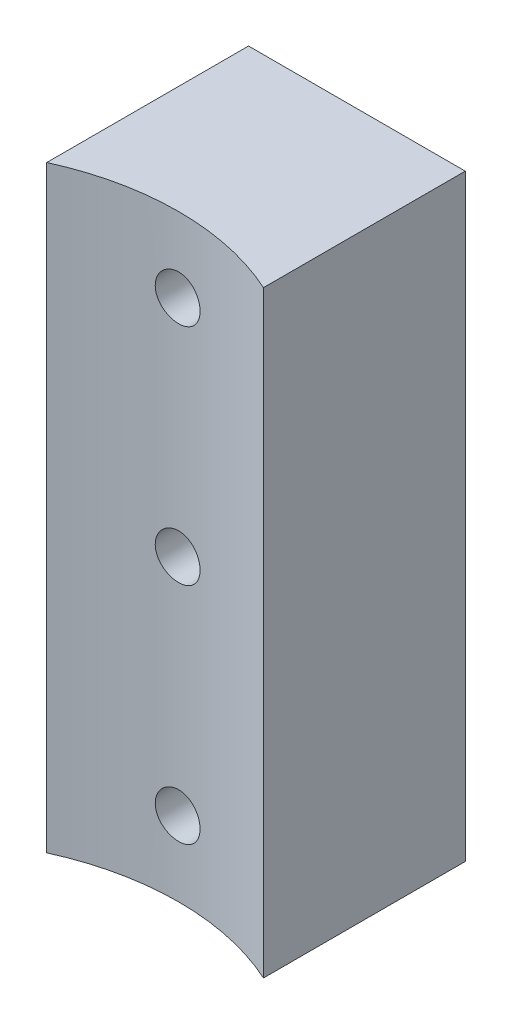
ISO-10303-21;
HEADER;
FILE_DESCRIPTION(('STEP AP214'),'2;1');
FILE_NAME('part.step','',(''),(''),'','','');
FILE_SCHEMA(('AUTOMOTIVE_DESIGN { 1 0 10303 214 1 1 1 1 }'));
ENDSEC;
DATA;
#1=APPLICATION_CONTEXT('core data for automotive mechanical design processes');
#2=APPLICATION_PROTOCOL_DEFINITION('international standard','automotive_design',2000,#1);
#3=PRODUCT_CONTEXT('',#1,'mechanical');
#4=PRODUCT('Part','Part','',(#3));
#5=PRODUCT_RELATED_PRODUCT_CATEGORY('part','',(#4));
#6=PRODUCT_DEFINITION_FORMATION('','',#4);
#7=PRODUCT_DEFINITION_CONTEXT('part definition',#1,'design');
#8=PRODUCT_DEFINITION('design','',#6,#7);
#9=PRODUCT_DEFINITION_SHAPE('','',#8);
#10=(LENGTH_UNIT() NAMED_UNIT(*) SI_UNIT(.MILLI.,.METRE.));
#11=(NAMED_UNIT(*) PLANE_ANGLE_UNIT() SI_UNIT($,.RADIAN.));
#12=(NAMED_UNIT(*) SI_UNIT($,.STERADIAN.) SOLID_ANGLE_UNIT());
#13=UNCERTAINTY_MEASURE_WITH_UNIT(LENGTH_MEASURE(1.E-05),#10,'distance_accuracy_value','');
#14=(GEOMETRIC_REPRESENTATION_CONTEXT(3) GLOBAL_UNCERTAINTY_ASSIGNED_CONTEXT((#13)) GLOBAL_UNIT_ASSIGNED_CONTEXT((#10,
#11,#12)) REPRESENTATION_CONTEXT('',''));
#15=CARTESIAN_POINT('',(0.,0.,0.));
#16=DIRECTION('',(0.,0.,1.));
#17=DIRECTION('',(1.,0.,0.));
#18=AXIS2_PLACEMENT_3D('',#15,#16,#17);
#19=CARTESIAN_POINT('',(0.,80.,45.355140872393));
#20=DIRECTION('',(0.,-1.,0.));
#21=DIRECTION('',(0.,0.,-1.));
#22=AXIS2_PLACEMENT_3D('',#19,#20,#21);
#23=CYLINDRICAL_SURFACE('',#22,35.);
#24=CARTESIAN_POINT('',(-3.,70.,10.4839493240676));
#25=CARTESIAN_POINT('',(-2.99999266095691,70.1681788977969,10.4839476198831));
#26=CARTESIAN_POINT('',(-2.98581034508464,70.3364718555865,10.4827195690312));
#27=CARTESIAN_POINT('',(-2.92944387718635,70.668400071108,10.4779401861653));
#28=CARTESIAN_POINT('',(-2.88722811123404,70.8320298525538,10.4743862312445));
#29=CARTESIAN_POINT('',(-2.77602575299662,71.1497763164806,10.4653605027679));
#30=CARTESIAN_POINT('',(-2.70705447640826,71.3038983830823,10.4598898265767));
#31=CARTESIAN_POINT('',(-2.54432647781201,71.5983417986807,10.4476484327925));
#32=CARTESIAN_POINT('',(-2.45057500494258,71.7386660618111,10.4408779906093));
#33=CARTESIAN_POINT('',(-2.24067380704697,72.0019468210089,10.4267793440726));
#34=CARTESIAN_POINT('',(-2.12447081430969,72.1248607834929,10.4194498388452));
#35=CARTESIAN_POINT('',(-1.87307803845592,72.3494663357357,10.4050708154877));
#36=CARTESIAN_POINT('',(-1.73788742116144,72.4511569926087,10.3980213096763));
#37=CARTESIAN_POINT('',(-1.45210217047512,72.6305716963779,10.3849841664228));
#38=CARTESIAN_POINT('',(-1.30148426539791,72.7082588039076,10.3789981715876));
#39=CARTESIAN_POINT('',(-0.989282152733716,72.8372248736093,10.3687765481909));
#40=CARTESIAN_POINT('',(-0.827698147061475,72.8885043218666,10.3645408874112));
#41=CARTESIAN_POINT('',(-0.498575054218786,72.9630766244092,10.3583062735014));
#42=CARTESIAN_POINT('',(-0.331051705301404,72.9864384709037,10.3563018073094));
#43=CARTESIAN_POINT('',(0.00554951687181451,73.0047257169121,10.3547367392413));
#44=CARTESIAN_POINT('',(0.174627359650706,72.9996516727498,10.3551760895541));
#45=CARTESIAN_POINT('',(0.509070191841324,72.9612675389711,10.3584446077199));
#46=CARTESIAN_POINT('',(0.674443766007422,72.9280316396164,10.3612674962547));
#47=CARTESIAN_POINT('',(0.997256506055928,72.834382628761,10.3689783939812));
#48=CARTESIAN_POINT('',(1.15469559272899,72.7739692460094,10.3738664237847));
#49=CARTESIAN_POINT('',(1.45740602670417,72.627597672851,10.3851685469964));
#50=CARTESIAN_POINT('',(1.6026612561083,72.5416063081392,10.3915846200892));
#51=CARTESIAN_POINT('',(1.87670479976717,72.3465438378033,10.4052219438467));
#52=CARTESIAN_POINT('',(2.0054927602542,72.2374722364782,10.4124432118031));
#53=CARTESIAN_POINT('',(2.24337983249144,71.9989274115879,10.4269069372816));
#54=CARTESIAN_POINT('',(2.35241430046894,71.8693897117684,10.4341493882716));
#55=CARTESIAN_POINT('',(2.54719973764136,71.593814336155,10.4478158774214));
#56=CARTESIAN_POINT('',(2.63295068598783,71.4477766455869,10.4542399148484));
#57=CARTESIAN_POINT('',(2.77873275129372,71.1433008088583,10.4655433191656));
#58=CARTESIAN_POINT('',(2.83876042932541,70.984861008014,10.4704224794993));
#59=CARTESIAN_POINT('',(2.93134369450066,70.660100511375,10.4780796259716));
#60=CARTESIAN_POINT('',(2.96389989316699,70.4937799910943,10.4808576588816));
#61=CARTESIAN_POINT('',(3.00053403997774,70.1585451904919,10.4839903442085));
#62=CARTESIAN_POINT('',(3.00470217287089,69.9896408341738,10.4843526708947));
#63=CARTESIAN_POINT('',(2.98467818807446,69.6535358314843,10.4826331742699));
#64=CARTESIAN_POINT('',(2.96048635048195,69.4863351683029,10.4805513750984));
#65=CARTESIAN_POINT('',(2.88450436177439,69.1586431948189,10.4741851877669));
#66=CARTESIAN_POINT('',(2.8327563709266,68.9981420378853,10.4699041647198));
#67=CARTESIAN_POINT('',(2.70317389532559,68.6880999611053,10.4596246741063));
#68=CARTESIAN_POINT('',(2.62533896819065,68.538559227178,10.4536261774153));
#69=CARTESIAN_POINT('',(2.44556416469073,68.2542704319917,10.440569016248));
#70=CARTESIAN_POINT('',(2.34356423538402,68.1195604686071,10.4335077268092));
#71=CARTESIAN_POINT('',(2.11844147546403,67.8691423551176,10.4191294466342));
#72=CARTESIAN_POINT('',(1.99531826047652,67.7534345508645,10.4118124512469));
#73=CARTESIAN_POINT('',(1.73105402731211,67.5439970271157,10.3977243081168));
#74=CARTESIAN_POINT('',(1.58986645530175,67.450325934563,10.3909546471913));
#75=CARTESIAN_POINT('',(1.29371299875351,67.2880232282786,10.3787453903888));
#76=CARTESIAN_POINT('',(1.13874725876361,67.2193913518968,10.3733057805603));
#77=CARTESIAN_POINT('',(0.819645734517399,67.1092157912916,10.3643763484736));
#78=CARTESIAN_POINT('',(0.65552250479355,67.0676359646391,10.3608839256061));
#79=CARTESIAN_POINT('',(0.322592960793778,67.0126266986178,10.356231794647));
#80=CARTESIAN_POINT('',(0.153786740881582,66.9991966924382,10.3550720395859));
#81=CARTESIAN_POINT('',(-0.183139370810549,67.0008750821372,10.3552158573381));
#82=CARTESIAN_POINT('',(-0.35125972839602,67.0158921579829,10.3565115477539));
#83=CARTESIAN_POINT('',(-0.682581136937826,67.0738478591427,10.3614050914978));
#84=CARTESIAN_POINT('',(-0.845782181536314,67.1167865205418,10.3650029478013));
#85=CARTESIAN_POINT('',(-1.16263730873111,67.2293430218768,10.3740972209368));
#86=CARTESIAN_POINT('',(-1.31629202900732,67.298959077572,10.3795935107952));
#87=CARTESIAN_POINT('',(-1.60974810184892,67.4628838846323,10.3918700486257));
#88=CARTESIAN_POINT('',(-1.74954965509232,67.5571922782303,10.3986502779943));
#89=CARTESIAN_POINT('',(-2.01179846018097,67.7681675615409,10.4127597969763));
#90=CARTESIAN_POINT('',(-2.1341911912239,67.8849021138727,10.4200907062253));
#91=CARTESIAN_POINT('',(-2.35769690654863,68.1372917927201,10.4344615574563));
#92=CARTESIAN_POINT('',(-2.45880473667584,68.2729514887808,10.4415014286323));
#93=CARTESIAN_POINT('',(-2.63701593547982,68.5596186650063,10.4545080517243));
#94=CARTESIAN_POINT('',(-2.71407186567634,68.7106557064792,10.4604726732226));
#95=CARTESIAN_POINT('',(-2.84163046603466,69.0234732227605,10.4706275648487));
#96=CARTESIAN_POINT('',(-2.89216358839389,69.1852411353663,10.4748198687842));
#97=CARTESIAN_POINT('',(-2.95240722581038,69.4566320780792,10.4798800238554));
#98=CARTESIAN_POINT('',(-2.97023070444527,69.564510957119,10.4813989701122));
#99=CARTESIAN_POINT('',(-2.99402945794011,69.781577186907,10.483434172228));
#100=CARTESIAN_POINT('',(-3.00000476685127,69.890764533894,10.4839504309686));
#101=CARTESIAN_POINT('',(-3.,70.,10.4839493240676));
#102=B_SPLINE_CURVE_WITH_KNOTS('',3,(#24,#25,#26,#27,#28,#29,#30,#31,#32,#33,#34,#35,#36,#37,
#38,#39,#40,#41,#42,#43,#44,#45,#46,#47,#48,#49,#50,#51,#52,#53,#54,#55,#56,#57,#58,#59,#60,#61,
#62,#63,#64,#65,#66,#67,#68,#69,#70,#71,#72,#73,#74,#75,#76,#77,#78,#79,#80,#81,#82,#83,#84,#85,
#86,#87,#88,#89,#90,#91,#92,#93,#94,#95,#96,#97,#98,#99,#100,#101),.UNSPECIFIED.,.T.,.F.,(4,2,2,
2,2,2,2,2,2,2,2,2,2,2,2,2,2,2,2,2,2,2,2,2,2,2,2,2,2,2,2,2,2,2,2,2,2,2,4),(0.,0.5041378451549,
1.00884518512539,1.51326404003696,2.01757613044268,2.52309976273194,3.02864561100068,
3.53496561920688,4.04127630725862,4.54633315507158,5.0513801219166,5.55510070289603,
6.05882631148133,6.56320811562687,7.06760075362891,7.57361533214636,8.07963036375613,
8.58571302310646,9.09178441661878,9.59624734203882,10.1007052851759,10.6043936277359,
11.1080905122643,11.6130525231886,12.1180237237333,12.6243235404852,13.1306180462274,
13.6362347291713,14.1418412311696,14.6458273992463,15.1498142186598,15.6537673362459,
16.1577131524622,16.6632040203355,17.1688171527569,17.6754213142688,18.1814425380561,
18.5088908177618,18.836338156391),.UNSPECIFIED.);
#103=CARTESIAN_POINT('',(-3.,70.,10.4839493240676));
#104=VERTEX_POINT('',#103);
#105=EDGE_CURVE('E99',#104,#104,#102,.T.);
#106=ORIENTED_EDGE('',*,*,#105,.T.);
#107=EDGE_LOOP('',(#106));
#108=FACE_BOUND('',#107,.T.);
#109=CARTESIAN_POINT('',(-3.,40.,10.4839493240676));
#110=CARTESIAN_POINT('',(-2.99999266095691,40.1681788977969,10.4839476198831));
#111=CARTESIAN_POINT('',(-2.98581034508464,40.3364718555865,10.4827195690312));
#112=CARTESIAN_POINT('',(-2.92944387718635,40.668400071108,10.4779401861653));
#113=CARTESIAN_POINT('',(-2.88722811123404,40.8320298525538,10.4743862312445));
#114=CARTESIAN_POINT('',(-2.77602575299661,41.1497763164806,10.4653605027679));
#115=CARTESIAN_POINT('',(-2.70705447640826,41.3038983830823,10.4598898265767));
#116=CARTESIAN_POINT('',(-2.54432647781201,41.5983417986807,10.4476484327925));
#117=CARTESIAN_POINT('',(-2.45057500494258,41.7386660618111,10.4408779906093));
#118=CARTESIAN_POINT('',(-2.24067380704696,42.0019468210089,10.4267793440726));
#119=CARTESIAN_POINT('',(-2.12447081430967,42.1248607834929,10.4194498388452));
#120=CARTESIAN_POINT('',(-1.87307803845591,42.3494663357357,10.4050708154877));
#121=CARTESIAN_POINT('',(-1.73788742116142,42.4511569926087,10.3980213096763));
#122=CARTESIAN_POINT('',(-1.45210217047511,42.6305716963779,10.3849841664228));
#123=CARTESIAN_POINT('',(-1.3014842653979,42.7082588039076,10.3789981715876));
#124=CARTESIAN_POINT('',(-0.989282152733707,42.8372248736093,10.3687765481909));
#125=CARTESIAN_POINT('',(-0.827698147061466,42.8885043218666,10.3645408874112));
#126=CARTESIAN_POINT('',(-0.498575054218778,42.9630766244091,10.3583062735014));
#127=CARTESIAN_POINT('',(-0.331051705301396,42.9864384709037,10.3563018073094));
#128=CARTESIAN_POINT('',(0.00554951687182248,43.0047257169121,10.3547367392413));
#129=CARTESIAN_POINT('',(0.174627359650714,42.9996516727498,10.3551760895541));
#130=CARTESIAN_POINT('',(0.509070191841332,42.9612675389711,10.3584446077199));
#131=CARTESIAN_POINT('',(0.674443766007428,42.9280316396164,10.3612674962547));
#132=CARTESIAN_POINT('',(0.997256506055934,42.834382628761,10.3689783939812));
#133=CARTESIAN_POINT('',(1.154695592729,42.7739692460094,10.3738664237847));
#134=CARTESIAN_POINT('',(1.45740602670418,42.627597672851,10.3851685469964));
#135=CARTESIAN_POINT('',(1.6026612561083,42.5416063081392,10.3915846200892));
#136=CARTESIAN_POINT('',(1.87670479976717,42.3465438378033,10.4052219438467));
#137=CARTESIAN_POINT('',(2.0054927602542,42.2374722364782,10.4124432118031));
#138=CARTESIAN_POINT('',(2.24337983249145,41.9989274115879,10.4269069372816));
#139=CARTESIAN_POINT('',(2.35241430046895,41.8693897117684,10.4341493882716));
#140=CARTESIAN_POINT('',(2.54719973764136,41.593814336155,10.4478158774214));
#141=CARTESIAN_POINT('',(2.63295068598784,41.4477766455869,10.4542399148484));
#142=CARTESIAN_POINT('',(2.77873275129373,41.1433008088582,10.4655433191656));
#143=CARTESIAN_POINT('',(2.83876042932541,40.9848610080139,10.4704224794993));
#144=CARTESIAN_POINT('',(2.93134369450066,40.6601005113749,10.4780796259716));
#145=CARTESIAN_POINT('',(2.963899893167,40.4937799910943,10.4808576588816));
#146=CARTESIAN_POINT('',(3.00053403997774,40.1585451904919,10.4839903442085));
#147=CARTESIAN_POINT('',(3.00470217287089,39.9896408341738,10.4843526708947));
#148=CARTESIAN_POINT('',(2.98467818807446,39.6535358314843,10.4826331742699));
#149=CARTESIAN_POINT('',(2.96048635048195,39.4863351683029,10.4805513750984));
#150=CARTESIAN_POINT('',(2.88450436177439,39.1586431948189,10.4741851877669));
#151=CARTESIAN_POINT('',(2.8327563709266,38.9981420378853,10.4699041647198));
#152=CARTESIAN_POINT('',(2.70317389532559,38.6880999611053,10.4596246741063));
#153=CARTESIAN_POINT('',(2.62533896819065,38.538559227178,10.4536261774153));
#154=CARTESIAN_POINT('',(2.44556416469073,38.2542704319917,10.440569016248));
#155=CARTESIAN_POINT('',(2.34356423538402,38.1195604686071,10.4335077268092));
#156=CARTESIAN_POINT('',(2.11844147546403,37.8691423551176,10.4191294466342));
#157=CARTESIAN_POINT('',(1.99531826047652,37.7534345508645,10.4118124512469));
#158=CARTESIAN_POINT('',(1.7310540273121,37.5439970271157,10.3977243081168));
#159=CARTESIAN_POINT('',(1.58986645530174,37.450325934563,10.3909546471913));
#160=CARTESIAN_POINT('',(1.2937129987535,37.2880232282786,10.3787453903888));
#161=CARTESIAN_POINT('',(1.13874725876359,37.2193913518968,10.3733057805603));
#162=CARTESIAN_POINT('',(0.819645734517386,37.1092157912916,10.3643763484736));
#163=CARTESIAN_POINT('',(0.655522504793538,37.067635964639,10.3608839256061));
#164=CARTESIAN_POINT('',(0.322592960793767,37.0126266986178,10.356231794647));
#165=CARTESIAN_POINT('',(0.153786740881569,36.9991966924382,10.3550720395859));
#166=CARTESIAN_POINT('',(-0.183139370810562,37.0008750821372,10.3552158573381));
#167=CARTESIAN_POINT('',(-0.351259728396031,37.0158921579829,10.3565115477539));
#168=CARTESIAN_POINT('',(-0.682581136937835,37.0738478591427,10.3614050914978));
#169=CARTESIAN_POINT('',(-0.845782181536322,37.1167865205418,10.3650029478012));
#170=CARTESIAN_POINT('',(-1.16263730873112,37.2293430218768,10.3740972209368));
#171=CARTESIAN_POINT('',(-1.31629202900733,37.298959077572,10.3795935107952));
#172=CARTESIAN_POINT('',(-1.60974810184893,37.4628838846323,10.3918700486257));
#173=CARTESIAN_POINT('',(-1.74954965509232,37.5571922782303,10.3986502779943));
#174=CARTESIAN_POINT('',(-2.01179846018098,37.7681675615409,10.4127597969763));
#175=CARTESIAN_POINT('',(-2.13419119122391,37.8849021138727,10.4200907062253));
#176=CARTESIAN_POINT('',(-2.35769690654864,38.1372917927201,10.4344615574563));
#177=CARTESIAN_POINT('',(-2.45880473667584,38.2729514887808,10.4415014286323));
#178=CARTESIAN_POINT('',(-2.63701593547982,38.5596186650063,10.4545080517243));
#179=CARTESIAN_POINT('',(-2.71407186567635,38.7106557064792,10.4604726732226));
#180=CARTESIAN_POINT('',(-2.84163046603466,39.0234732227605,10.4706275648487));
#181=CARTESIAN_POINT('',(-2.89216358839389,39.1852411353663,10.4748198687842));
#182=CARTESIAN_POINT('',(-2.95240722581038,39.4566320780792,10.4798800238554));
#183=CARTESIAN_POINT('',(-2.97023070444527,39.5645109571189,10.4813989701123));
#184=CARTESIAN_POINT('',(-2.9940294579401,39.781577186907,10.483434172228));
#185=CARTESIAN_POINT('',(-3.00000476685127,39.890764533894,10.4839504309686));
#186=CARTESIAN_POINT('',(-3.,40.,10.4839493240676));
#187=B_SPLINE_CURVE_WITH_KNOTS('',3,(#109,#110,#111,#112,#113,#114,#115,#116,#117,#118,#119,
#120,#121,#122,#123,#124,#125,#126,#127,#128,#129,#130,#131,#132,#133,#134,#135,#136,#137,#138,
#139,#140,#141,#142,#143,#144,#145,#146,#147,#148,#149,#150,#151,#152,#153,#154,#155,#156,#157,
#158,#159,#160,#161,#162,#163,#164,#165,#166,#167,#168,#169,#170,#171,#172,#173,#174,#175,#176,
#177,#178,#179,#180,#181,#182,#183,#184,#185,#186),.UNSPECIFIED.,.T.,.F.,(4,2,2,2,2,2,2,2,2,2,2,
2,2,2,2,2,2,2,2,2,2,2,2,2,2,2,2,2,2,2,2,2,2,2,2,2,2,2,4),(0.,0.504137845154907,1.0088451851254,
1.51326404003697,2.01757613044269,2.52309976273197,3.0286456110007,3.53496561920689,
4.04127630725863,4.54633315507159,5.0513801219166,5.55510070289604,6.05882631148134,
6.56320811562686,7.06760075362891,7.57361533214636,8.07963036375613,8.58571302310648,
9.09178441661878,9.59624734203881,10.1007052851759,10.6043936277359,11.1080905122643,
11.6130525231886,12.1180237237333,12.6243235404852,13.1306180462274,13.6362347291713,
14.1418412311696,14.6458273992463,15.1498142186598,15.6537673362459,16.1577131524622,
16.6632040203355,17.1688171527569,17.6754213142688,18.1814425380561,18.5088908177617,
18.836338156391),.UNSPECIFIED.);
#188=CARTESIAN_POINT('',(-3.,40.,10.4839493240676));
#189=VERTEX_POINT('',#188);
#190=EDGE_CURVE('E116',#189,#189,#187,.T.);
#191=ORIENTED_EDGE('',*,*,#190,.T.);
#192=EDGE_LOOP('',(#191));
#193=FACE_BOUND('',#192,.T.);
#194=CARTESIAN_POINT('',(-3.,10.,10.4839493240676));
#195=CARTESIAN_POINT('',(-2.99999266095691,10.1681788977969,10.4839476198831));
#196=CARTESIAN_POINT('',(-2.98581034508464,10.3364718555865,10.4827195690312));
#197=CARTESIAN_POINT('',(-2.92944387718635,10.668400071108,10.4779401861653));
#198=CARTESIAN_POINT('',(-2.88722811123404,10.8320298525538,10.4743862312445));
#199=CARTESIAN_POINT('',(-2.77602575299661,11.1497763164806,10.4653605027679));
#200=CARTESIAN_POINT('',(-2.70705447640826,11.3038983830823,10.4598898265767));
#201=CARTESIAN_POINT('',(-2.54432647781201,11.5983417986807,10.4476484327925));
#202=CARTESIAN_POINT('',(-2.45057500494258,11.7386660618111,10.4408779906093));
#203=CARTESIAN_POINT('',(-2.24067380704696,12.0019468210089,10.4267793440726));
#204=CARTESIAN_POINT('',(-2.12447081430967,12.1248607834929,10.4194498388452));
#205=CARTESIAN_POINT('',(-1.87307803845591,12.3494663357358,10.4050708154877));
#206=CARTESIAN_POINT('',(-1.73788742116142,12.4511569926087,10.3980213096763));
#207=CARTESIAN_POINT('',(-1.45210217047511,12.6305716963779,10.3849841664228));
#208=CARTESIAN_POINT('',(-1.3014842653979,12.7082588039076,10.3789981715876));
#209=CARTESIAN_POINT('',(-0.989282152733704,12.8372248736093,10.3687765481909));
#210=CARTESIAN_POINT('',(-0.827698147061464,12.8885043218666,10.3645408874112));
#211=CARTESIAN_POINT('',(-0.498575054218777,12.9630766244092,10.3583062735014));
#212=CARTESIAN_POINT('',(-0.331051705301395,12.9864384709037,10.3563018073094));
#213=CARTESIAN_POINT('',(0.0055495168718231,13.0047257169121,10.3547367392413));
#214=CARTESIAN_POINT('',(0.174627359650714,12.9996516727498,10.3551760895541));
#215=CARTESIAN_POINT('',(0.509070191841332,12.9612675389711,10.3584446077199));
#216=CARTESIAN_POINT('',(0.674443766007428,12.9280316396164,10.3612674962547));
#217=CARTESIAN_POINT('',(0.997256506055934,12.834382628761,10.3689783939812));
#218=CARTESIAN_POINT('',(1.154695592729,12.7739692460094,10.3738664237847));
#219=CARTESIAN_POINT('',(1.45740602670418,12.627597672851,10.3851685469964));
#220=CARTESIAN_POINT('',(1.6026612561083,12.5416063081392,10.3915846200892));
#221=CARTESIAN_POINT('',(1.87670479976717,12.3465438378033,10.4052219438467));
#222=CARTESIAN_POINT('',(2.0054927602542,12.2374722364782,10.4124432118031));
#223=CARTESIAN_POINT('',(2.24337983249145,11.9989274115879,10.4269069372816));
#224=CARTESIAN_POINT('',(2.35241430046895,11.8693897117684,10.4341493882716));
#225=CARTESIAN_POINT('',(2.54719973764137,11.593814336155,10.4478158774214));
#226=CARTESIAN_POINT('',(2.63295068598784,11.4477766455869,10.4542399148484));
#227=CARTESIAN_POINT('',(2.77873275129373,11.1433008088582,10.4655433191656));
#228=CARTESIAN_POINT('',(2.83876042932541,10.9848610080139,10.4704224794993));
#229=CARTESIAN_POINT('',(2.93134369450066,10.6601005113749,10.4780796259716));
#230=CARTESIAN_POINT('',(2.963899893167,10.4937799910943,10.4808576588816));
#231=CARTESIAN_POINT('',(3.00053403997774,10.1585451904919,10.4839903442085));
#232=CARTESIAN_POINT('',(3.00470217287089,9.98964083417379,10.4843526708947));
#233=CARTESIAN_POINT('',(2.98467818807446,9.65353583148434,10.4826331742699));
#234=CARTESIAN_POINT('',(2.96048635048195,9.48633516830293,10.4805513750984));
#235=CARTESIAN_POINT('',(2.88450436177439,9.15864319481893,10.4741851877669));
#236=CARTESIAN_POINT('',(2.8327563709266,8.99814203788532,10.4699041647198));
#237=CARTESIAN_POINT('',(2.70317389532559,8.68809996110534,10.4596246741063));
#238=CARTESIAN_POINT('',(2.62533896819065,8.538559227178,10.4536261774153));
#239=CARTESIAN_POINT('',(2.44556416469073,8.25427043199173,10.440569016248));
#240=CARTESIAN_POINT('',(2.34356423538402,8.11956046860708,10.4335077268092));
#241=CARTESIAN_POINT('',(2.11844147546403,7.8691423551176,10.4191294466342));
#242=CARTESIAN_POINT('',(1.99531826047651,7.7534345508645,10.4118124512469));
#243=CARTESIAN_POINT('',(1.7310540273121,7.54399702711568,10.3977243081168));
#244=CARTESIAN_POINT('',(1.58986645530174,7.45032593456302,10.3909546471913));
#245=CARTESIAN_POINT('',(1.2937129987535,7.28802322827864,10.3787453903888));
#246=CARTESIAN_POINT('',(1.1387472587636,7.21939135189683,10.3733057805603));
#247=CARTESIAN_POINT('',(0.819645734517389,7.10921579129159,10.3643763484736));
#248=CARTESIAN_POINT('',(0.655522504793541,7.06763596463904,10.3608839256061));
#249=CARTESIAN_POINT('',(0.322592960793769,7.01262669861777,10.356231794647));
#250=CARTESIAN_POINT('',(0.153786740881572,6.99919669243817,10.3550720395859));
#251=CARTESIAN_POINT('',(-0.18313937081056,7.0008750821372,10.3552158573381));
#252=CARTESIAN_POINT('',(-0.35125972839603,7.01589215798287,10.3565115477539));
#253=CARTESIAN_POINT('',(-0.682581136937835,7.07384785914267,10.3614050914978));
#254=CARTESIAN_POINT('',(-0.845782181536321,7.11678652054176,10.3650029478012));
#255=CARTESIAN_POINT('',(-1.16263730873111,7.2293430218768,10.3740972209368));
#256=CARTESIAN_POINT('',(-1.31629202900733,7.29895907757196,10.3795935107952));
#257=CARTESIAN_POINT('',(-1.60974810184893,7.46288388463228,10.3918700486257));
#258=CARTESIAN_POINT('',(-1.74954965509232,7.55719227823028,10.3986502779943));
#259=CARTESIAN_POINT('',(-2.01179846018098,7.76816756154087,10.4127597969763));
#260=CARTESIAN_POINT('',(-2.13419119122391,7.88490211387266,10.4200907062253));
#261=CARTESIAN_POINT('',(-2.35769690654864,8.13729179272008,10.4344615574563));
#262=CARTESIAN_POINT('',(-2.45880473667584,8.27295148878081,10.4415014286323));
#263=CARTESIAN_POINT('',(-2.63701593547982,8.55961866500635,10.4545080517243));
#264=CARTESIAN_POINT('',(-2.71407186567635,8.71065570647919,10.4604726732226));
#265=CARTESIAN_POINT('',(-2.84163046603466,9.0234732227605,10.4706275648487));
#266=CARTESIAN_POINT('',(-2.89216358839389,9.1852411353663,10.4748198687842));
#267=CARTESIAN_POINT('',(-2.95240722581038,9.45663207807922,10.4798800238554));
#268=CARTESIAN_POINT('',(-2.97023070444527,9.56451095711896,10.4813989701122));
#269=CARTESIAN_POINT('',(-2.9940294579401,9.78157718690703,10.483434172228));
#270=CARTESIAN_POINT('',(-3.00000476685127,9.89076453389398,10.4839504309686));
#271=CARTESIAN_POINT('',(-3.,10.,10.4839493240676));
#272=B_SPLINE_CURVE_WITH_KNOTS('',3,(#194,#195,#196,#197,#198,#199,#200,#201,#202,#203,#204,
#205,#206,#207,#208,#209,#210,#211,#212,#213,#214,#215,#216,#217,#218,#219,#220,#221,#222,#223,
#224,#225,#226,#227,#228,#229,#230,#231,#232,#233,#234,#235,#236,#237,#238,#239,#240,#241,#242,
#243,#244,#245,#246,#247,#248,#249,#250,#251,#252,#253,#254,#255,#256,#257,#258,#259,#260,#261,
#262,#263,#264,#265,#266,#267,#268,#269,#270,#271),.UNSPECIFIED.,.T.,.F.,(4,2,2,2,2,2,2,2,2,2,2,
2,2,2,2,2,2,2,2,2,2,2,2,2,2,2,2,2,2,2,2,2,2,2,2,2,2,2,4),(0.,0.504137845154905,1.0088451851254,
1.51326404003696,2.01757613044269,2.52309976273197,3.0286456110007,3.53496561920689,
4.04127630725863,4.54633315507159,5.0513801219166,5.55510070289604,6.05882631148134,
6.56320811562686,7.06760075362891,7.57361533214636,8.07963036375614,8.58571302310648,
9.09178441661877,9.5962473420388,10.1007052851759,10.6043936277359,11.1080905122643,
11.6130525231886,12.1180237237333,12.6243235404852,13.1306180462274,13.6362347291713,
14.1418412311696,14.6458273992463,15.1498142186598,15.6537673362459,16.1577131524622,
16.6632040203355,17.1688171527569,17.6754213142688,18.1814425380561,18.5088908177617,
18.836338156391),.UNSPECIFIED.);
#273=CARTESIAN_POINT('',(-3.,10.,10.4839493240676));
#274=VERTEX_POINT('',#273);
#275=EDGE_CURVE('E137',#274,#274,#272,.T.);
#276=ORIENTED_EDGE('',*,*,#275,.T.);
#277=EDGE_LOOP('',(#276));
#278=FACE_BOUND('',#277,.T.);
#279=CARTESIAN_POINT('',(0.,0.,45.355140872393));
#280=DIRECTION('',(0.,-1.,0.));
#281=DIRECTION('',(0.,0.,-1.));
#282=AXIS2_PLACEMENT_3D('',#279,#280,#281);
#283=CIRCLE('',#282,35.);
#284=CARTESIAN_POINT('',(-14.5,0.,13.5));
#285=VERTEX_POINT('',#284);
#286=CARTESIAN_POINT('',(14.5,0.,13.5));
#287=VERTEX_POINT('',#286);
#288=EDGE_CURVE('E96',#285,#287,#283,.T.);
#289=ORIENTED_EDGE('',*,*,#288,.T.);
#290=DIRECTION('',(0.,-1.,0.));
#291=VECTOR('',#290,1.);
#292=CARTESIAN_POINT('',(14.5,80.,13.5));
#293=LINE('',#292,#291);
#294=CARTESIAN_POINT('',(14.5,80.,13.5));
#295=VERTEX_POINT('',#294);
#296=EDGE_CURVE('E11',#295,#287,#293,.T.);
#297=ORIENTED_EDGE('',*,*,#296,.F.);
#298=CARTESIAN_POINT('',(0.,80.,45.355140872393));
#299=DIRECTION('',(0.,-1.,0.));
#300=DIRECTION('',(0.,0.,-1.));
#301=AXIS2_PLACEMENT_3D('',#298,#299,#300);
#302=CIRCLE('',#301,35.);
#303=CARTESIAN_POINT('',(-14.5,80.,13.5));
#304=VERTEX_POINT('',#303);
#305=EDGE_CURVE('E84',#304,#295,#302,.T.);
#306=ORIENTED_EDGE('',*,*,#305,.F.);
#307=DIRECTION('',(0.,-1.,0.));
#308=VECTOR('',#307,1.);
#309=CARTESIAN_POINT('',(-14.5,80.,13.5));
#310=LINE('',#309,#308);
#311=EDGE_CURVE('E92',#304,#285,#310,.T.);
#312=ORIENTED_EDGE('',*,*,#311,.T.);
#313=EDGE_LOOP('',(#289,#297,#306,#312));
#314=FACE_BOUND('',#313,.T.);
#315=ADVANCED_FACE('F32',(#108,#193,#278,#314),#23,.F.);
#316=CARTESIAN_POINT('',(14.5,80.,-13.5));
#317=DIRECTION('',(-1.,0.,0.));
#318=DIRECTION('',(0.,0.,1.));
#319=AXIS2_PLACEMENT_3D('',#316,#317,#318);
#320=PLANE('',#319);
#321=DIRECTION('',(0.,0.,-1.));
#322=VECTOR('',#321,1.);
#323=CARTESIAN_POINT('',(14.5,0.,-13.5));
#324=LINE('',#323,#322);
#325=CARTESIAN_POINT('',(14.5,0.,-13.5));
#326=VERTEX_POINT('',#325);
#327=EDGE_CURVE('E88',#287,#326,#324,.T.);
#328=ORIENTED_EDGE('',*,*,#327,.T.);
#329=DIRECTION('',(0.,-1.,0.));
#330=VECTOR('',#329,1.);
#331=CARTESIAN_POINT('',(14.5,80.,-13.5));
#332=LINE('',#331,#330);
#333=CARTESIAN_POINT('',(14.5,80.,-13.5));
#334=VERTEX_POINT('',#333);
#335=EDGE_CURVE('E41',#334,#326,#332,.T.);
#336=ORIENTED_EDGE('',*,*,#335,.F.);
#337=DIRECTION('',(0.,0.,-1.));
#338=VECTOR('',#337,1.);
#339=CARTESIAN_POINT('',(14.5,80.,-13.5));
#340=LINE('',#339,#338);
#341=EDGE_CURVE('E79',#295,#334,#340,.T.);
#342=ORIENTED_EDGE('',*,*,#341,.F.);
#343=ORIENTED_EDGE('',*,*,#296,.T.);
#344=EDGE_LOOP('',(#328,#336,#342,#343));
#345=FACE_BOUND('',#344,.T.);
#346=ADVANCED_FACE('F87',(#345),#320,.F.);
#347=CARTESIAN_POINT('',(-14.5,80.,-13.5));
#348=DIRECTION('',(0.,0.,1.));
#349=DIRECTION('',(1.,0.,0.));
#350=AXIS2_PLACEMENT_3D('',#347,#348,#349);
#351=PLANE('',#350);
#352=CARTESIAN_POINT('',(0.,70.,-13.5));
#353=DIRECTION('',(0.,0.,-1.));
#354=DIRECTION('',(-1.,0.,0.));
#355=AXIS2_PLACEMENT_3D('',#352,#353,#354);
#356=CIRCLE('',#355,3.);
#357=CARTESIAN_POINT('',(-3.,70.,-13.5));
#358=VERTEX_POINT('',#357);
#359=EDGE_CURVE('E143',#358,#358,#356,.T.);
#360=ORIENTED_EDGE('',*,*,#359,.F.);
#361=EDGE_LOOP('',(#360));
#362=FACE_BOUND('',#361,.T.);
#363=CARTESIAN_POINT('',(0.,40.,-13.5));
#364=DIRECTION('',(0.,0.,-1.));
#365=DIRECTION('',(-1.,0.,0.));
#366=AXIS2_PLACEMENT_3D('',#363,#364,#365);
#367=CIRCLE('',#366,3.);
#368=CARTESIAN_POINT('',(-3.,40.,-13.5));
#369=VERTEX_POINT('',#368);
#370=EDGE_CURVE('E147',#369,#369,#367,.T.);
#371=ORIENTED_EDGE('',*,*,#370,.F.);
#372=EDGE_LOOP('',(#371));
#373=FACE_BOUND('',#372,.T.);
#374=CARTESIAN_POINT('',(0.,10.,-13.5));
#375=DIRECTION('',(0.,0.,-1.));
#376=DIRECTION('',(-1.,0.,0.));
#377=AXIS2_PLACEMENT_3D('',#374,#375,#376);
#378=CIRCLE('',#377,3.);
#379=CARTESIAN_POINT('',(-3.,10.,-13.5));
#380=VERTEX_POINT('',#379);
#381=EDGE_CURVE('E144',#380,#380,#378,.T.);
#382=ORIENTED_EDGE('',*,*,#381,.F.);
#383=EDGE_LOOP('',(#382));
#384=FACE_BOUND('',#383,.T.);
#385=DIRECTION('',(-1.,0.,0.));
#386=VECTOR('',#385,1.);
#387=CARTESIAN_POINT('',(-14.5,0.,-13.5));
#388=LINE('',#387,#386);
#389=CARTESIAN_POINT('',(-14.5,0.,-13.5));
#390=VERTEX_POINT('',#389);
#391=EDGE_CURVE('E66',#326,#390,#388,.T.);
#392=ORIENTED_EDGE('',*,*,#391,.T.);
#393=DIRECTION('',(0.,-1.,0.));
#394=VECTOR('',#393,1.);
#395=CARTESIAN_POINT('',(-14.5,80.,-13.5));
#396=LINE('',#395,#394);
#397=CARTESIAN_POINT('',(-14.5,80.,-13.5));
#398=VERTEX_POINT('',#397);
#399=EDGE_CURVE('E89',#398,#390,#396,.T.);
#400=ORIENTED_EDGE('',*,*,#399,.F.);
#401=DIRECTION('',(-1.,0.,0.));
#402=VECTOR('',#401,1.);
#403=CARTESIAN_POINT('',(-14.5,80.,-13.5));
#404=LINE('',#403,#402);
#405=EDGE_CURVE('E82',#334,#398,#404,.T.);
#406=ORIENTED_EDGE('',*,*,#405,.F.);
#407=ORIENTED_EDGE('',*,*,#335,.T.);
#408=EDGE_LOOP('',(#392,#400,#406,#407));
#409=FACE_BOUND('',#408,.T.);
#410=ADVANCED_FACE('F90',(#362,#373,#384,#409),#351,.F.);
#411=CARTESIAN_POINT('',(-14.5,80.,-13.5));
#412=DIRECTION('',(1.,0.,0.));
#413=DIRECTION('',(0.,0.,-1.));
#414=AXIS2_PLACEMENT_3D('',#411,#412,#413);
#415=PLANE('',#414);
#416=DIRECTION('',(0.,0.,1.));
#417=VECTOR('',#416,1.);
#418=CARTESIAN_POINT('',(-14.5,0.,-13.5));
#419=LINE('',#418,#417);
#420=EDGE_CURVE('E72',#390,#285,#419,.T.);
#421=ORIENTED_EDGE('',*,*,#420,.T.);
#422=ORIENTED_EDGE('',*,*,#311,.F.);
#423=DIRECTION('',(0.,0.,1.));
#424=VECTOR('',#423,1.);
#425=CARTESIAN_POINT('',(-14.5,80.,-13.5));
#426=LINE('',#425,#424);
#427=EDGE_CURVE('E49',#398,#304,#426,.T.);
#428=ORIENTED_EDGE('',*,*,#427,.F.);
#429=ORIENTED_EDGE('',*,*,#399,.T.);
#430=EDGE_LOOP('',(#421,#422,#428,#429));
#431=FACE_BOUND('',#430,.T.);
#432=ADVANCED_FACE('F104',(#431),#415,.F.);
#433=CARTESIAN_POINT('',(0.,80.,45.355140872393));
#434=DIRECTION('',(0.,-1.,0.));
#435=DIRECTION('',(0.,0.,-1.));
#436=AXIS2_PLACEMENT_3D('',#433,#434,#435);
#437=PLANE('',#436);
#438=ORIENTED_EDGE('',*,*,#305,.T.);
#439=ORIENTED_EDGE('',*,*,#341,.T.);
#440=ORIENTED_EDGE('',*,*,#405,.T.);
#441=ORIENTED_EDGE('',*,*,#427,.T.);
#442=EDGE_LOOP('',(#438,#439,#440,#441));
#443=FACE_BOUND('',#442,.T.);
#444=ADVANCED_FACE('F80',(#443),#437,.F.);
#445=CARTESIAN_POINT('',(0.,0.,45.355140872393));
#446=DIRECTION('',(0.,-1.,0.));
#447=DIRECTION('',(0.,0.,-1.));
#448=AXIS2_PLACEMENT_3D('',#445,#446,#447);
#449=PLANE('',#448);
#450=ORIENTED_EDGE('',*,*,#288,.F.);
#451=ORIENTED_EDGE('',*,*,#420,.F.);
#452=ORIENTED_EDGE('',*,*,#391,.F.);
#453=ORIENTED_EDGE('',*,*,#327,.F.);
#454=EDGE_LOOP('',(#450,#451,#452,#453));
#455=FACE_BOUND('',#454,.T.);
#456=ADVANCED_FACE('F107',(#455),#449,.T.);
#457=CARTESIAN_POINT('',(0.,10.,13.5));
#458=DIRECTION('',(0.,0.,-1.));
#459=DIRECTION('',(-1.,0.,0.));
#460=AXIS2_PLACEMENT_3D('',#457,#458,#459);
#461=CYLINDRICAL_SURFACE('',#460,3.);
#462=ORIENTED_EDGE('',*,*,#381,.T.);
#463=EDGE_LOOP('',(#462));
#464=FACE_BOUND('',#463,.T.);
#465=ORIENTED_EDGE('',*,*,#275,.F.);
#466=EDGE_LOOP('',(#465));
#467=FACE_BOUND('',#466,.T.);
#468=ADVANCED_FACE('F130',(#464,#467),#461,.F.);
#469=CARTESIAN_POINT('',(0.,40.,13.5));
#470=DIRECTION('',(0.,0.,-1.));
#471=DIRECTION('',(-1.,0.,0.));
#472=AXIS2_PLACEMENT_3D('',#469,#470,#471);
#473=CYLINDRICAL_SURFACE('',#472,3.);
#474=ORIENTED_EDGE('',*,*,#370,.T.);
#475=EDGE_LOOP('',(#474));
#476=FACE_BOUND('',#475,.T.);
#477=ORIENTED_EDGE('',*,*,#190,.F.);
#478=EDGE_LOOP('',(#477));
#479=FACE_BOUND('',#478,.T.);
#480=ADVANCED_FACE('F125',(#476,#479),#473,.F.);
#481=CARTESIAN_POINT('',(0.,70.,13.5));
#482=DIRECTION('',(0.,0.,-1.));
#483=DIRECTION('',(-1.,0.,0.));
#484=AXIS2_PLACEMENT_3D('',#481,#482,#483);
#485=CYLINDRICAL_SURFACE('',#484,3.);
#486=ORIENTED_EDGE('',*,*,#359,.T.);
#487=EDGE_LOOP('',(#486));
#488=FACE_BOUND('',#487,.T.);
#489=ORIENTED_EDGE('',*,*,#105,.F.);
#490=EDGE_LOOP('',(#489));
#491=FACE_BOUND('',#490,.T.);
#492=ADVANCED_FACE('F122',(#488,#491),#485,.F.);
#493=CLOSED_SHELL('',(#315,#346,#410,#432,#444,#456,#468,#480,#492));
#494=MANIFOLD_SOLID_BREP('B2',#493);
#495=ADVANCED_BREP_SHAPE_REPRESENTATION('',(#18,#494),#14);
#496=SHAPE_DEFINITION_REPRESENTATION(#9,#495);
ENDSEC;
END-ISO-10303-21;
